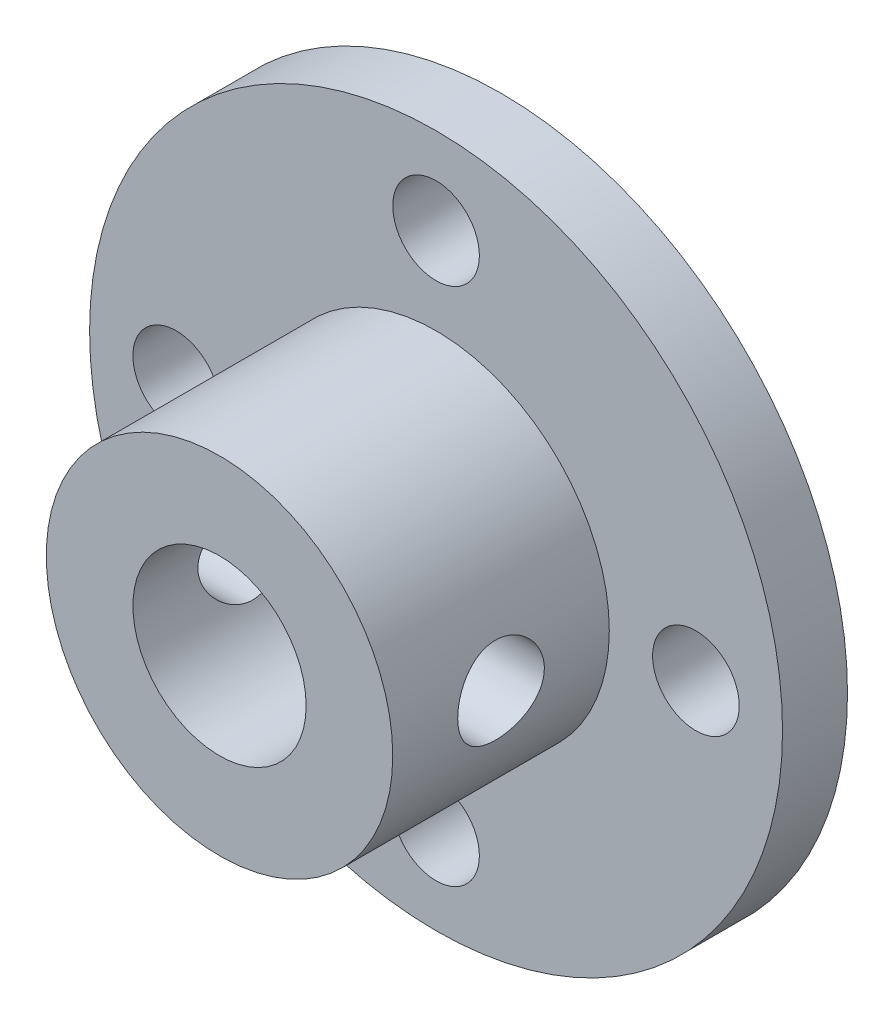
ISO-10303-21;
HEADER;
FILE_DESCRIPTION(('STEP AP214'),'2;1');
FILE_NAME('part.step','',(''),(''),'','','');
FILE_SCHEMA(('AUTOMOTIVE_DESIGN { 1 0 10303 214 1 1 1 1 }'));
ENDSEC;
DATA;
#1=APPLICATION_CONTEXT('core data for automotive mechanical design processes');
#2=APPLICATION_PROTOCOL_DEFINITION('international standard','automotive_design',2000,#1);
#3=PRODUCT_CONTEXT('',#1,'mechanical');
#4=PRODUCT('Part','Part','',(#3));
#5=PRODUCT_RELATED_PRODUCT_CATEGORY('part','',(#4));
#6=PRODUCT_DEFINITION_FORMATION('','',#4);
#7=PRODUCT_DEFINITION_CONTEXT('part definition',#1,'design');
#8=PRODUCT_DEFINITION('design','',#6,#7);
#9=PRODUCT_DEFINITION_SHAPE('','',#8);
#10=(LENGTH_UNIT() NAMED_UNIT(*) SI_UNIT(.MILLI.,.METRE.));
#11=(NAMED_UNIT(*) PLANE_ANGLE_UNIT() SI_UNIT($,.RADIAN.));
#12=(NAMED_UNIT(*) SI_UNIT($,.STERADIAN.) SOLID_ANGLE_UNIT());
#13=UNCERTAINTY_MEASURE_WITH_UNIT(LENGTH_MEASURE(1.E-05),#10,'distance_accuracy_value','');
#14=(GEOMETRIC_REPRESENTATION_CONTEXT(3) GLOBAL_UNCERTAINTY_ASSIGNED_CONTEXT((#13)) GLOBAL_UNIT_ASSIGNED_CONTEXT((#10,
#11,#12)) REPRESENTATION_CONTEXT('',''));
#15=CARTESIAN_POINT('',(0.,0.,0.));
#16=DIRECTION('',(0.,0.,1.));
#17=DIRECTION('',(1.,0.,0.));
#18=AXIS2_PLACEMENT_3D('',#15,#16,#17);
#19=CARTESIAN_POINT('',(-12.,0.,3.));
#20=DIRECTION('',(0.,0.,-1.));
#21=DIRECTION('',(-1.,0.,0.));
#22=AXIS2_PLACEMENT_3D('',#19,#20,#21);
#23=CYLINDRICAL_SURFACE('',#22,2.);
#24=CARTESIAN_POINT('',(-12.,0.,3.));
#25=DIRECTION('',(0.,0.,1.));
#26=DIRECTION('',(1.,0.,0.));
#27=AXIS2_PLACEMENT_3D('',#24,#25,#26);
#28=CIRCLE('',#27,2.);
#29=CARTESIAN_POINT('',(-10.,0.,3.));
#30=VERTEX_POINT('',#29);
#31=EDGE_CURVE('E57',#30,#30,#28,.T.);
#32=ORIENTED_EDGE('',*,*,#31,.T.);
#33=EDGE_LOOP('',(#32));
#34=FACE_BOUND('',#33,.T.);
#35=CARTESIAN_POINT('',(-12.,0.,0.));
#36=DIRECTION('',(0.,0.,1.));
#37=DIRECTION('',(1.,0.,0.));
#38=AXIS2_PLACEMENT_3D('',#35,#36,#37);
#39=CIRCLE('',#38,2.);
#40=CARTESIAN_POINT('',(-10.,0.,0.));
#41=VERTEX_POINT('',#40);
#42=EDGE_CURVE('E71',#41,#41,#39,.T.);
#43=ORIENTED_EDGE('',*,*,#42,.F.);
#44=EDGE_LOOP('',(#43));
#45=FACE_BOUND('',#44,.T.);
#46=ADVANCED_FACE('F39',(#34,#45),#23,.F.);
#47=CARTESIAN_POINT('',(0.,12.,3.));
#48=DIRECTION('',(0.,0.,-1.));
#49=DIRECTION('',(-1.,0.,0.));
#50=AXIS2_PLACEMENT_3D('',#47,#48,#49);
#51=CYLINDRICAL_SURFACE('',#50,2.);
#52=CARTESIAN_POINT('',(0.,12.,3.));
#53=DIRECTION('',(0.,0.,1.));
#54=DIRECTION('',(1.,0.,0.));
#55=AXIS2_PLACEMENT_3D('',#52,#53,#54);
#56=CIRCLE('',#55,2.);
#57=CARTESIAN_POINT('',(2.00000000000004,12.,3.));
#58=VERTEX_POINT('',#57);
#59=EDGE_CURVE('E164',#58,#58,#56,.T.);
#60=ORIENTED_EDGE('',*,*,#59,.T.);
#61=EDGE_LOOP('',(#60));
#62=FACE_BOUND('',#61,.T.);
#63=CARTESIAN_POINT('',(0.,12.,0.));
#64=DIRECTION('',(0.,0.,1.));
#65=DIRECTION('',(1.,0.,0.));
#66=AXIS2_PLACEMENT_3D('',#63,#64,#65);
#67=CIRCLE('',#66,2.);
#68=CARTESIAN_POINT('',(2.00000000000004,12.,0.));
#69=VERTEX_POINT('',#68);
#70=EDGE_CURVE('E68',#69,#69,#67,.T.);
#71=ORIENTED_EDGE('',*,*,#70,.F.);
#72=EDGE_LOOP('',(#71));
#73=FACE_BOUND('',#72,.T.);
#74=ADVANCED_FACE('F127',(#62,#73),#51,.F.);
#75=CARTESIAN_POINT('',(12.,0.,3.));
#76=DIRECTION('',(0.,0.,-1.));
#77=DIRECTION('',(-1.,0.,0.));
#78=AXIS2_PLACEMENT_3D('',#75,#76,#77);
#79=CYLINDRICAL_SURFACE('',#78,2.);
#80=CARTESIAN_POINT('',(12.,0.,3.));
#81=DIRECTION('',(0.,0.,1.));
#82=DIRECTION('',(1.,0.,0.));
#83=AXIS2_PLACEMENT_3D('',#80,#81,#82);
#84=CIRCLE('',#83,2.);
#85=CARTESIAN_POINT('',(14.,0.,3.));
#86=VERTEX_POINT('',#85);
#87=EDGE_CURVE('E141',#86,#86,#84,.T.);
#88=ORIENTED_EDGE('',*,*,#87,.T.);
#89=EDGE_LOOP('',(#88));
#90=FACE_BOUND('',#89,.T.);
#91=CARTESIAN_POINT('',(12.,0.,0.));
#92=DIRECTION('',(0.,0.,1.));
#93=DIRECTION('',(1.,0.,0.));
#94=AXIS2_PLACEMENT_3D('',#91,#92,#93);
#95=CIRCLE('',#94,2.);
#96=CARTESIAN_POINT('',(14.,0.,0.));
#97=VERTEX_POINT('',#96);
#98=EDGE_CURVE('E64',#97,#97,#95,.T.);
#99=ORIENTED_EDGE('',*,*,#98,.F.);
#100=EDGE_LOOP('',(#99));
#101=FACE_BOUND('',#100,.T.);
#102=ADVANCED_FACE('F130',(#90,#101),#79,.F.);
#103=CARTESIAN_POINT('',(-1.25693328198353E-13,-12.,3.));
#104=DIRECTION('',(0.,0.,-1.));
#105=DIRECTION('',(-1.,0.,0.));
#106=AXIS2_PLACEMENT_3D('',#103,#104,#105);
#107=CYLINDRICAL_SURFACE('',#106,2.);
#108=CARTESIAN_POINT('',(-1.25693328198353E-13,-12.,3.));
#109=DIRECTION('',(0.,0.,1.));
#110=DIRECTION('',(1.,0.,0.));
#111=AXIS2_PLACEMENT_3D('',#108,#109,#110);
#112=CIRCLE('',#111,2.);
#113=CARTESIAN_POINT('',(1.99999999999987,-12.,3.));
#114=VERTEX_POINT('',#113);
#115=EDGE_CURVE('E76',#114,#114,#112,.T.);
#116=ORIENTED_EDGE('',*,*,#115,.T.);
#117=EDGE_LOOP('',(#116));
#118=FACE_BOUND('',#117,.T.);
#119=CARTESIAN_POINT('',(-1.25693328198353E-13,-12.,0.));
#120=DIRECTION('',(0.,0.,1.));
#121=DIRECTION('',(1.,0.,0.));
#122=AXIS2_PLACEMENT_3D('',#119,#120,#121);
#123=CIRCLE('',#122,2.);
#124=CARTESIAN_POINT('',(1.99999999999987,-12.,0.));
#125=VERTEX_POINT('',#124);
#126=EDGE_CURVE('E61',#125,#125,#123,.T.);
#127=ORIENTED_EDGE('',*,*,#126,.F.);
#128=EDGE_LOOP('',(#127));
#129=FACE_BOUND('',#128,.T.);
#130=ADVANCED_FACE('F41',(#118,#129),#107,.F.);
#131=CARTESIAN_POINT('',(0.,0.,3.));
#132=DIRECTION('',(0.,0.,-1.));
#133=DIRECTION('',(-1.,0.,0.));
#134=AXIS2_PLACEMENT_3D('',#131,#132,#133);
#135=CYLINDRICAL_SURFACE('',#134,16.);
#136=CARTESIAN_POINT('',(0.,0.,3.));
#137=DIRECTION('',(0.,0.,1.));
#138=DIRECTION('',(1.,0.,0.));
#139=AXIS2_PLACEMENT_3D('',#136,#137,#138);
#140=CIRCLE('',#139,16.);
#141=CARTESIAN_POINT('',(16.,0.,3.));
#142=VERTEX_POINT('',#141);
#143=EDGE_CURVE('E10',#142,#142,#140,.T.);
#144=ORIENTED_EDGE('',*,*,#143,.F.);
#145=EDGE_LOOP('',(#144));
#146=FACE_BOUND('',#145,.T.);
#147=CARTESIAN_POINT('',(0.,0.,0.));
#148=DIRECTION('',(0.,0.,1.));
#149=DIRECTION('',(1.,0.,0.));
#150=AXIS2_PLACEMENT_3D('',#147,#148,#149);
#151=CIRCLE('',#150,16.);
#152=CARTESIAN_POINT('',(16.,0.,0.));
#153=VERTEX_POINT('',#152);
#154=EDGE_CURVE('E74',#153,#153,#151,.T.);
#155=ORIENTED_EDGE('',*,*,#154,.T.);
#156=EDGE_LOOP('',(#155));
#157=FACE_BOUND('',#156,.T.);
#158=ADVANCED_FACE('F117',(#146,#157),#135,.T.);
#159=CARTESIAN_POINT('',(0.,0.,3.));
#160=DIRECTION('',(0.,0.,1.));
#161=DIRECTION('',(1.,0.,0.));
#162=AXIS2_PLACEMENT_3D('',#159,#160,#161);
#163=PLANE('',#162);
#164=ORIENTED_EDGE('',*,*,#115,.F.);
#165=EDGE_LOOP('',(#164));
#166=FACE_BOUND('',#165,.T.);
#167=ORIENTED_EDGE('',*,*,#87,.F.);
#168=EDGE_LOOP('',(#167));
#169=FACE_BOUND('',#168,.T.);
#170=ORIENTED_EDGE('',*,*,#59,.F.);
#171=EDGE_LOOP('',(#170));
#172=FACE_BOUND('',#171,.T.);
#173=ORIENTED_EDGE('',*,*,#31,.F.);
#174=EDGE_LOOP('',(#173));
#175=FACE_BOUND('',#174,.T.);
#176=CARTESIAN_POINT('',(0.,0.,3.));
#177=DIRECTION('',(0.,0.,1.));
#178=DIRECTION('',(1.,0.,0.));
#179=AXIS2_PLACEMENT_3D('',#176,#177,#178);
#180=CIRCLE('',#179,8.);
#181=CARTESIAN_POINT('',(8.,0.,3.));
#182=VERTEX_POINT('',#181);
#183=EDGE_CURVE('E52',#182,#182,#180,.T.);
#184=ORIENTED_EDGE('',*,*,#183,.F.);
#185=EDGE_LOOP('',(#184));
#186=FACE_BOUND('',#185,.T.);
#187=ORIENTED_EDGE('',*,*,#143,.T.);
#188=EDGE_LOOP('',(#187));
#189=FACE_BOUND('',#188,.T.);
#190=ADVANCED_FACE('F113',(#166,#169,#172,#175,#186,#189),#163,.T.);
#191=CARTESIAN_POINT('',(0.,0.,0.));
#192=DIRECTION('',(0.,0.,1.));
#193=DIRECTION('',(1.,0.,0.));
#194=AXIS2_PLACEMENT_3D('',#191,#192,#193);
#195=PLANE('',#194);
#196=ORIENTED_EDGE('',*,*,#126,.T.);
#197=EDGE_LOOP('',(#196));
#198=FACE_BOUND('',#197,.T.);
#199=ORIENTED_EDGE('',*,*,#98,.T.);
#200=EDGE_LOOP('',(#199));
#201=FACE_BOUND('',#200,.T.);
#202=ORIENTED_EDGE('',*,*,#70,.T.);
#203=EDGE_LOOP('',(#202));
#204=FACE_BOUND('',#203,.T.);
#205=ORIENTED_EDGE('',*,*,#42,.T.);
#206=EDGE_LOOP('',(#205));
#207=FACE_BOUND('',#206,.T.);
#208=ORIENTED_EDGE('',*,*,#154,.F.);
#209=EDGE_LOOP('',(#208));
#210=FACE_BOUND('',#209,.T.);
#211=CARTESIAN_POINT('',(0.,0.,0.));
#212=DIRECTION('',(0.,0.,1.));
#213=DIRECTION('',(1.,0.,0.));
#214=AXIS2_PLACEMENT_3D('',#211,#212,#213);
#215=CIRCLE('',#214,4.);
#216=CARTESIAN_POINT('',(4.,0.,0.));
#217=VERTEX_POINT('',#216);
#218=EDGE_CURVE('E153',#217,#217,#215,.T.);
#219=ORIENTED_EDGE('',*,*,#218,.T.);
#220=EDGE_LOOP('',(#219));
#221=FACE_BOUND('',#220,.T.);
#222=ADVANCED_FACE('F111',(#198,#201,#204,#207,#210,#221),#195,.F.);
#223=CARTESIAN_POINT('',(0.,0.,13.));
#224=DIRECTION('',(0.,0.,-1.));
#225=DIRECTION('',(-1.,0.,0.));
#226=AXIS2_PLACEMENT_3D('',#223,#224,#225);
#227=CYLINDRICAL_SURFACE('',#226,4.);
#228=CARTESIAN_POINT('',(-4.,0.,10.));
#229=CARTESIAN_POINT('',(-3.99999426810082,-0.105143925902467,9.99999339536562));
#230=CARTESIAN_POINT('',(-3.99580982039513,-0.210413199395125,9.99165985375789));
#231=CARTESIAN_POINT('',(-3.97948312074314,-0.417840470537792,9.95869423931692));
#232=CARTESIAN_POINT('',(-3.96732575657839,-0.519992173427259,9.93403121400437));
#233=CARTESIAN_POINT('',(-3.93632558806751,-0.717867089760898,9.86961238276674));
#234=CARTESIAN_POINT('',(-3.91750878355075,-0.813613605878293,9.82991523150407));
#235=CARTESIAN_POINT('',(-3.87491553031523,-0.996945233613197,9.73685875727003));
#236=CARTESIAN_POINT('',(-3.85113947267051,-1.08453098798012,9.68350051150227));
#237=CARTESIAN_POINT('',(-3.79912516516124,-1.25501563552382,9.56096550102943));
#238=CARTESIAN_POINT('',(-3.77070398255074,-1.33731042224422,9.49102704152072));
#239=CARTESIAN_POINT('',(-3.71319940493486,-1.48955888973396,9.33895704150593));
#240=CARTESIAN_POINT('',(-3.68411552418069,-1.55950316621353,9.25681629645512));
#241=CARTESIAN_POINT('',(-3.62597902394695,-1.69050400090055,9.07503330095324));
#242=CARTESIAN_POINT('',(-3.59710373940264,-1.75045067110327,8.97452780330818));
#243=CARTESIAN_POINT('',(-3.54571957544641,-1.85233645378139,8.76326532802757));
#244=CARTESIAN_POINT('',(-3.52320615213979,-1.89428842993267,8.6525157425545));
#245=CARTESIAN_POINT('',(-3.48915734075617,-1.95626488437718,8.43066978915616));
#246=CARTESIAN_POINT('',(-3.47704543167427,-1.97745171416088,8.31999109586521));
#247=CARTESIAN_POINT('',(-3.46363779897055,-2.00085398661769,8.09604232444105));
#248=CARTESIAN_POINT('',(-3.46233138686576,-2.00308817674615,7.98277491825769));
#249=CARTESIAN_POINT('',(-3.47021860514497,-1.98937457434459,7.77142795136926));
#250=CARTESIAN_POINT('',(-3.47817527324027,-1.97556911907364,7.6731519375539));
#251=CARTESIAN_POINT('',(-3.50152457467701,-1.93387969811386,7.48055618125392));
#252=CARTESIAN_POINT('',(-3.51691957663553,-1.9059912477953,7.38623770938937));
#253=CARTESIAN_POINT('',(-3.55374952825482,-1.83641956077201,7.20154173486868));
#254=CARTESIAN_POINT('',(-3.57531681327997,-1.79443013423199,7.11130720242842));
#255=CARTESIAN_POINT('',(-3.62206808562807,-1.698083375336,6.93873141481999));
#256=CARTESIAN_POINT('',(-3.64725369560381,-1.64372048762494,6.85639372879982));
#257=CARTESIAN_POINT('',(-3.70226315806572,-1.51613210982558,6.69095749451355));
#258=CARTESIAN_POINT('',(-3.73227020473492,-1.44138891673856,6.60908625284769));
#259=CARTESIAN_POINT('',(-3.79095246600814,-1.27911115748275,6.4585291628182));
#260=CARTESIAN_POINT('',(-3.81962703917602,-1.19157051314857,6.38984961593223));
#261=CARTESIAN_POINT('',(-3.87403974565928,-1.0010330116637,6.26462867794055));
#262=CARTESIAN_POINT('',(-3.89957968324015,-0.897507183198818,6.20879905510852));
#263=CARTESIAN_POINT('',(-3.94315762242485,-0.680932430977593,6.11580594191398));
#264=CARTESIAN_POINT('',(-3.96120157887106,-0.567891152530552,6.07862762996967));
#265=CARTESIAN_POINT('',(-3.98648667482871,-0.345532983321404,6.02704919256665));
#266=CARTESIAN_POINT('',(-3.9944987660262,-0.236683061096652,6.01101752850644));
#267=CARTESIAN_POINT('',(-4.00146026918207,-0.0175591998987032,5.99707053773103));
#268=CARTESIAN_POINT('',(-4.00041397442637,0.0927140397398176,5.99914662872106));
#269=CARTESIAN_POINT('',(-3.9898238450687,0.302465943971974,6.02041337683749));
#270=CARTESIAN_POINT('',(-3.98094491376337,0.402118816099861,6.03826506545999));
#271=CARTESIAN_POINT('',(-3.9564434262968,0.596813784603883,6.08847614379024));
#272=CARTESIAN_POINT('',(-3.94082012668824,0.691855371382174,6.12083713290699));
#273=CARTESIAN_POINT('',(-3.90368502827176,0.877777216899146,6.19999693286607));
#274=CARTESIAN_POINT('',(-3.88201763539261,0.968460794011607,6.24718210023258));
#275=CARTESIAN_POINT('',(-3.83487948634835,1.14092272339854,6.35421507129314));
#276=CARTESIAN_POINT('',(-3.80940711133877,1.22269725955318,6.41406826919079));
#277=CARTESIAN_POINT('',(-3.75416442672396,1.38353537857843,6.55152085066143));
#278=CARTESIAN_POINT('',(-3.72421769686998,1.46154415563805,6.6302857368903));
#279=CARTESIAN_POINT('',(-3.6652478321764,1.60371264223771,6.79985030255546));
#280=CARTESIAN_POINT('',(-3.63622534800094,1.66786277142375,6.89065823769584));
#281=CARTESIAN_POINT('',(-3.58102384412979,1.78341582895804,7.08728730834595));
#282=CARTESIAN_POINT('',(-3.55505059178121,1.8340509916005,7.19362253218896));
#283=CARTESIAN_POINT('',(-3.51148144588269,1.91616565186941,7.41502013514993));
#284=CARTESIAN_POINT('',(-3.493874764435,1.94766983173403,7.53007105293378));
#285=CARTESIAN_POINT('',(-3.47123002051604,1.98772337493374,7.75382044576941));
#286=CARTESIAN_POINT('',(-3.4651476693013,1.9981859928109,7.86206850687048));
#287=CARTESIAN_POINT('',(-3.46330709283207,2.0013783087524,8.07889413432905));
#288=CARTESIAN_POINT('',(-3.4675443925278,1.99411569324648,8.18747153747572));
#289=CARTESIAN_POINT('',(-3.48475724102153,1.96385225118662,8.39096700306687));
#290=CARTESIAN_POINT('',(-3.49686188965317,1.94241662868607,8.48620094028948));
#291=CARTESIAN_POINT('',(-3.52742032375305,1.88635071644882,8.67161623884873));
#292=CARTESIAN_POINT('',(-3.54587615139337,1.85171618231984,8.76179596418406));
#293=CARTESIAN_POINT('',(-3.58857060729071,1.76763149060113,8.94124970197307));
#294=CARTESIAN_POINT('',(-3.61311444791841,1.7173422756314,9.03005580365806));
#295=CARTESIAN_POINT('',(-3.66470663269721,1.60430194327478,9.19854907236252));
#296=CARTESIAN_POINT('',(-3.69175627591221,1.54154434248312,9.27823146104222));
#297=CARTESIAN_POINT('',(-3.74924646316184,1.39640665332275,9.43628396470935));
#298=CARTESIAN_POINT('',(-3.77969966613256,1.31256884599452,9.51331820470058));
#299=CARTESIAN_POINT('',(-3.83755504519861,1.13230961246639,9.65252596687054));
#300=CARTESIAN_POINT('',(-3.8649555725239,1.03588144661039,9.71469147893981));
#301=CARTESIAN_POINT('',(-3.91396019133075,0.83186319356589,9.82247272542414));
#302=CARTESIAN_POINT('',(-3.93552192987866,0.72419900755346,9.86796833847294));
#303=CARTESIAN_POINT('',(-3.97002682597974,0.501484202276172,9.93961633551482));
#304=CARTESIAN_POINT('',(-3.98299446726136,0.386455599178199,9.96582369361143));
#305=CARTESIAN_POINT('',(-3.99390923826956,0.225203892981789,9.98779482217148));
#306=CARTESIAN_POINT('',(-3.99618730680502,0.180323758883128,9.99236528173268));
#307=CARTESIAN_POINT('',(-3.99923393953631,0.0903034636101822,9.99846933102817));
#308=CARTESIAN_POINT('',(-4.00000246206762,0.0451632952932564,10.0000028369404));
#309=CARTESIAN_POINT('',(-4.,0.,10.));
#310=B_SPLINE_CURVE_WITH_KNOTS('',3,(#228,#229,#230,#231,#232,#233,#234,#235,#236,#237,#238,
#239,#240,#241,#242,#243,#244,#245,#246,#247,#248,#249,#250,#251,#252,#253,#254,#255,#256,#257,
#258,#259,#260,#261,#262,#263,#264,#265,#266,#267,#268,#269,#270,#271,#272,#273,#274,#275,#276,
#277,#278,#279,#280,#281,#282,#283,#284,#285,#286,#287,#288,#289,#290,#291,#292,#293,#294,#295,
#296,#297,#298,#299,#300,#301,#302,#303,#304,#305,#306,#307,#308,#309),.UNSPECIFIED.,.T.,.F.,(4,
2,2,2,2,2,2,2,2,2,2,2,2,2,2,2,2,2,2,2,2,2,2,2,2,2,2,2,2,2,2,2,2,2,2,2,2,2,2,2,4),(0.,
0.315248514840585,0.631096299418395,0.945724310984596,1.26032752116314,1.59396351743618,
1.92785247530807,2.28763452861505,2.64715895796562,2.98516024280459,3.32282714658041,
3.62011424818641,3.91749607851357,4.22180480336974,4.52625042520443,4.86929882667757,
5.21251069197373,5.57166044428881,5.93052433824559,6.25966580942691,6.58865129022952,
6.89213813012244,7.19565843261863,7.50785712055797,7.82018901496679,8.16319221288838,
8.50643177230864,8.86629364323452,9.22569023890902,9.55058615006093,9.87534119729357,
10.1691586049771,10.463070575767,10.7767291356057,11.0905512228726,11.4425048551434,
11.7946476676249,12.1492802732705,12.502898172423,12.6383056026783,12.7737167702213),.UNSPECIFIED.);
#311=CARTESIAN_POINT('',(-4.,0.,10.));
#312=VERTEX_POINT('',#311);
#313=EDGE_CURVE('E102',#312,#312,#310,.T.);
#314=ORIENTED_EDGE('',*,*,#313,.F.);
#315=EDGE_LOOP('',(#314));
#316=FACE_BOUND('',#315,.T.);
#317=CARTESIAN_POINT('',(4.,0.,6.));
#318=CARTESIAN_POINT('',(3.99999426810083,-0.105143925902467,6.00000660463438));
#319=CARTESIAN_POINT('',(3.99580982039513,-0.210413199395125,6.00834014624211));
#320=CARTESIAN_POINT('',(3.97948312074314,-0.417840470537792,6.04130576068308));
#321=CARTESIAN_POINT('',(3.96732575657839,-0.519992173427259,6.06596878599563));
#322=CARTESIAN_POINT('',(3.93632558806751,-0.717867089760897,6.13038761723326));
#323=CARTESIAN_POINT('',(3.91750878355075,-0.813613605878292,6.17008476849594));
#324=CARTESIAN_POINT('',(3.87491553031523,-0.996945233613197,6.26314124272997));
#325=CARTESIAN_POINT('',(3.8511394726705,-1.08453098798012,6.31649948849773));
#326=CARTESIAN_POINT('',(3.79912516516124,-1.25501563552382,6.43903449897057));
#327=CARTESIAN_POINT('',(3.77070398255074,-1.33731042224422,6.50897295847928));
#328=CARTESIAN_POINT('',(3.71319940493486,-1.48955888973396,6.66104295849407));
#329=CARTESIAN_POINT('',(3.68411552418069,-1.55950316621353,6.74318370354488));
#330=CARTESIAN_POINT('',(3.62597902394695,-1.69050400090055,6.92496669904676));
#331=CARTESIAN_POINT('',(3.59710373940264,-1.75045067110327,7.02547219669182));
#332=CARTESIAN_POINT('',(3.54571957544641,-1.85233645378139,7.23673467197243));
#333=CARTESIAN_POINT('',(3.52320615213979,-1.89428842993267,7.3474842574455));
#334=CARTESIAN_POINT('',(3.48915734075617,-1.95626488437718,7.56933021084384));
#335=CARTESIAN_POINT('',(3.47704543167427,-1.97745171416088,7.68000890413479));
#336=CARTESIAN_POINT('',(3.46363779897055,-2.00085398661769,7.90395767555895));
#337=CARTESIAN_POINT('',(3.46233138686576,-2.00308817674615,8.01722508174231));
#338=CARTESIAN_POINT('',(3.47021860514497,-1.98937457434459,8.22857204863074));
#339=CARTESIAN_POINT('',(3.47817527324027,-1.97556911907364,8.3268480624461));
#340=CARTESIAN_POINT('',(3.50152457467701,-1.93387969811386,8.51944381874609));
#341=CARTESIAN_POINT('',(3.51691957663553,-1.9059912477953,8.61376229061063));
#342=CARTESIAN_POINT('',(3.55374952825482,-1.83641956077201,8.79845826513132));
#343=CARTESIAN_POINT('',(3.57531681327997,-1.79443013423199,8.88869279757158));
#344=CARTESIAN_POINT('',(3.62206808562807,-1.69808337533601,9.06126858518001));
#345=CARTESIAN_POINT('',(3.64725369560381,-1.64372048762494,9.14360627120018));
#346=CARTESIAN_POINT('',(3.70226315806572,-1.51613210982558,9.30904250548645));
#347=CARTESIAN_POINT('',(3.73227020473492,-1.44138891673856,9.39091374715231));
#348=CARTESIAN_POINT('',(3.79095246600814,-1.27911115748275,9.5414708371818));
#349=CARTESIAN_POINT('',(3.81962703917602,-1.19157051314857,9.61015038406777));
#350=CARTESIAN_POINT('',(3.87403974565928,-1.0010330116637,9.73537132205946));
#351=CARTESIAN_POINT('',(3.89957968324014,-0.897507183198818,9.79120094489148));
#352=CARTESIAN_POINT('',(3.94315762242484,-0.680932430977594,9.88419405808602));
#353=CARTESIAN_POINT('',(3.96120157887106,-0.567891152530552,9.92137237003033));
#354=CARTESIAN_POINT('',(3.98648667482871,-0.345532983321404,9.97295080743335));
#355=CARTESIAN_POINT('',(3.9944987660262,-0.236683061096652,9.98898247149356));
#356=CARTESIAN_POINT('',(4.00146026918207,-0.0175591998987035,10.002929462269));
#357=CARTESIAN_POINT('',(4.00041397442637,0.0927140397398172,10.0008533712789));
#358=CARTESIAN_POINT('',(3.9898238450687,0.302465943971973,9.97958662316251));
#359=CARTESIAN_POINT('',(3.98094491376337,0.40211881609986,9.96173493454001));
#360=CARTESIAN_POINT('',(3.95644342629681,0.596813784603882,9.91152385620976));
#361=CARTESIAN_POINT('',(3.94082012668824,0.691855371382173,9.87916286709301));
#362=CARTESIAN_POINT('',(3.90368502827176,0.877777216899145,9.80000306713393));
#363=CARTESIAN_POINT('',(3.88201763539262,0.968460794011606,9.75281789976743));
#364=CARTESIAN_POINT('',(3.83487948634835,1.14092272339854,9.64578492870687));
#365=CARTESIAN_POINT('',(3.80940711133877,1.22269725955318,9.58593173080921));
#366=CARTESIAN_POINT('',(3.75416442672396,1.38353537857843,9.44847914933857));
#367=CARTESIAN_POINT('',(3.72421769686999,1.46154415563805,9.36971426310971));
#368=CARTESIAN_POINT('',(3.6652478321764,1.60371264223771,9.20014969744455));
#369=CARTESIAN_POINT('',(3.63622534800094,1.66786277142375,9.10934176230416));
#370=CARTESIAN_POINT('',(3.58102384412979,1.78341582895804,8.91271269165405));
#371=CARTESIAN_POINT('',(3.55505059178121,1.8340509916005,8.80637746781104));
#372=CARTESIAN_POINT('',(3.51148144588269,1.91616565186941,8.58497986485007));
#373=CARTESIAN_POINT('',(3.493874764435,1.94766983173403,8.46992894706622));
#374=CARTESIAN_POINT('',(3.47123002051604,1.98772337493374,8.24617955423059));
#375=CARTESIAN_POINT('',(3.4651476693013,1.9981859928109,8.13793149312952));
#376=CARTESIAN_POINT('',(3.46330709283206,2.0013783087524,7.92110586567095));
#377=CARTESIAN_POINT('',(3.4675443925278,1.99411569324648,7.81252846252428));
#378=CARTESIAN_POINT('',(3.48475724102153,1.96385225118662,7.60903299693313));
#379=CARTESIAN_POINT('',(3.49686188965317,1.94241662868607,7.51379905971052));
#380=CARTESIAN_POINT('',(3.52742032375305,1.88635071644882,7.32838376115127));
#381=CARTESIAN_POINT('',(3.54587615139337,1.85171618231984,7.23820403581594));
#382=CARTESIAN_POINT('',(3.58857060729071,1.76763149060113,7.05875029802693));
#383=CARTESIAN_POINT('',(3.61311444791841,1.7173422756314,6.96994419634194));
#384=CARTESIAN_POINT('',(3.66470663269721,1.60430194327479,6.80145092763748));
#385=CARTESIAN_POINT('',(3.69175627591221,1.54154434248312,6.72176853895778));
#386=CARTESIAN_POINT('',(3.74924646316184,1.39640665332275,6.56371603529065));
#387=CARTESIAN_POINT('',(3.77969966613256,1.31256884599452,6.48668179529942));
#388=CARTESIAN_POINT('',(3.83755504519861,1.13230961246639,6.34747403312946));
#389=CARTESIAN_POINT('',(3.8649555725239,1.03588144661039,6.28530852106019));
#390=CARTESIAN_POINT('',(3.91396019133075,0.831863193565892,6.17752727457586));
#391=CARTESIAN_POINT('',(3.93552192987866,0.724199007553462,6.13203166152707));
#392=CARTESIAN_POINT('',(3.97002682597974,0.501484202276174,6.06038366448518));
#393=CARTESIAN_POINT('',(3.98299446726136,0.386455599178201,6.03417630638857));
#394=CARTESIAN_POINT('',(3.99390923826956,0.225203892981791,6.01220517782852));
#395=CARTESIAN_POINT('',(3.99618730680501,0.18032375888313,6.00763471826732));
#396=CARTESIAN_POINT('',(3.99923393953631,0.0903034636101833,6.00153066897183));
#397=CARTESIAN_POINT('',(4.00000246206762,0.0451632952932569,5.99999716305958));
#398=CARTESIAN_POINT('',(4.,0.,6.));
#399=B_SPLINE_CURVE_WITH_KNOTS('',3,(#317,#318,#319,#320,#321,#322,#323,#324,#325,#326,#327,
#328,#329,#330,#331,#332,#333,#334,#335,#336,#337,#338,#339,#340,#341,#342,#343,#344,#345,#346,
#347,#348,#349,#350,#351,#352,#353,#354,#355,#356,#357,#358,#359,#360,#361,#362,#363,#364,#365,
#366,#367,#368,#369,#370,#371,#372,#373,#374,#375,#376,#377,#378,#379,#380,#381,#382,#383,#384,
#385,#386,#387,#388,#389,#390,#391,#392,#393,#394,#395,#396,#397,#398),.UNSPECIFIED.,.T.,.F.,(4,
2,2,2,2,2,2,2,2,2,2,2,2,2,2,2,2,2,2,2,2,2,2,2,2,2,2,2,2,2,2,2,2,2,2,2,2,2,2,2,4),(0.,
0.315248514840585,0.631096299418395,0.945724310984597,1.26032752116313,1.59396351743618,
1.92785247530807,2.28763452861505,2.64715895796562,2.98516024280459,3.32282714658041,
3.62011424818641,3.91749607851357,4.22180480336974,4.52625042520443,4.86929882667757,
5.21251069197372,5.57166044428881,5.93052433824559,6.25966580942691,6.58865129022952,
6.89213813012244,7.19565843261863,7.50785712055797,7.82018901496678,8.16319221288837,
8.50643177230863,8.86629364323451,9.22569023890902,9.55058615006093,9.87534119729357,
10.1691586049771,10.463070575767,10.7767291356057,11.0905512228726,11.4425048551434,
11.7946476676249,12.1492802732705,12.502898172423,12.6383056026783,12.7737167702213),.UNSPECIFIED.);
#400=CARTESIAN_POINT('',(4.,0.,6.));
#401=VERTEX_POINT('',#400);
#402=EDGE_CURVE('E97',#401,#401,#399,.T.);
#403=ORIENTED_EDGE('',*,*,#402,.F.);
#404=EDGE_LOOP('',(#403));
#405=FACE_BOUND('',#404,.T.);
#406=CARTESIAN_POINT('',(0.,0.,13.));
#407=DIRECTION('',(0.,0.,1.));
#408=DIRECTION('',(1.,0.,0.));
#409=AXIS2_PLACEMENT_3D('',#406,#407,#408);
#410=CIRCLE('',#409,4.);
#411=CARTESIAN_POINT('',(4.,0.,13.));
#412=VERTEX_POINT('',#411);
#413=EDGE_CURVE('E155',#412,#412,#410,.T.);
#414=ORIENTED_EDGE('',*,*,#413,.T.);
#415=EDGE_LOOP('',(#414));
#416=FACE_BOUND('',#415,.T.);
#417=ORIENTED_EDGE('',*,*,#218,.F.);
#418=EDGE_LOOP('',(#417));
#419=FACE_BOUND('',#418,.T.);
#420=ADVANCED_FACE('F107',(#316,#405,#416,#419),#227,.F.);
#421=CARTESIAN_POINT('',(0.,0.,13.));
#422=DIRECTION('',(0.,0.,-1.));
#423=DIRECTION('',(-1.,0.,0.));
#424=AXIS2_PLACEMENT_3D('',#421,#422,#423);
#425=CYLINDRICAL_SURFACE('',#424,8.);
#426=CARTESIAN_POINT('',(-8.,0.,10.));
#427=CARTESIAN_POINT('',(-7.9999981315735,-0.110501451559641,9.99999689901579));
#428=CARTESIAN_POINT('',(-7.99768770842435,-0.221037543774351,9.99081126563495));
#429=CARTESIAN_POINT('',(-7.98869485106526,-0.438941765027377,9.95436646492399));
#430=CARTESIAN_POINT('',(-7.98200993893301,-0.546308062494319,9.92709705394953));
#431=CARTESIAN_POINT('',(-7.96500835109376,-0.754694496243435,9.85541432871722));
#432=CARTESIAN_POINT('',(-7.95469603789411,-0.855722084573336,9.81102160171297));
#433=CARTESIAN_POINT('',(-7.93153791743495,-1.04889617587257,9.70642481327354));
#434=CARTESIAN_POINT('',(-7.91869202472209,-1.14104237913168,9.64622021850804));
#435=CARTESIAN_POINT('',(-7.89156551455591,-1.31573590306789,9.51039894712776));
#436=CARTESIAN_POINT('',(-7.87726276197502,-1.39807425341474,9.43451790005459));
#437=CARTESIAN_POINT('',(-7.84898160157248,-1.54899856960443,9.27006372678795));
#438=CARTESIAN_POINT('',(-7.83500323053157,-1.61758298259892,9.18148916940409));
#439=CARTESIAN_POINT('',(-7.80873034264225,-1.74003539039863,8.99253969768401));
#440=CARTESIAN_POINT('',(-7.79646392619748,-1.79366962123352,8.89200902558836));
#441=CARTESIAN_POINT('',(-7.77532659757355,-1.88319587806766,8.68300211778662));
#442=CARTESIAN_POINT('',(-7.76645514259224,-1.91909074058685,8.57452715555731));
#443=CARTESIAN_POINT('',(-7.7533396892843,-1.97140644907302,8.35500866906445));
#444=CARTESIAN_POINT('',(-7.74900654662681,-1.98820302444274,8.24406013861601));
#445=CARTESIAN_POINT('',(-7.74519149946122,-2.00301570008854,8.02084190800087));
#446=CARTESIAN_POINT('',(-7.74570880570571,-2.00103485575748,7.90857242574382));
#447=CARTESIAN_POINT('',(-7.75145607355756,-1.97864869951961,7.6887789230062));
#448=CARTESIAN_POINT('',(-7.75657150676391,-1.95869112025418,7.58120583804623));
#449=CARTESIAN_POINT('',(-7.77075612894758,-1.90163224920399,7.37098526545192));
#450=CARTESIAN_POINT('',(-7.77982559958985,-1.86452973609252,7.26833812929477));
#451=CARTESIAN_POINT('',(-7.80100151874212,-1.77385263724958,7.06968264499716));
#452=CARTESIAN_POINT('',(-7.81313769959755,-1.72011555631056,6.97375177094724));
#453=CARTESIAN_POINT('',(-7.83906281127988,-1.59780836801993,6.79210838699091));
#454=CARTESIAN_POINT('',(-7.85285203112837,-1.52923566507845,6.70639766924367));
#455=CARTESIAN_POINT('',(-7.88101174053188,-1.37688456624163,6.54506184574079));
#456=CARTESIAN_POINT('',(-7.89538759304001,-1.29272834422115,6.46979401325153));
#457=CARTESIAN_POINT('',(-7.92274620771675,-1.11281589000493,6.3343716767148));
#458=CARTESIAN_POINT('',(-7.93572892732543,-1.01705930361059,6.27421763431525));
#459=CARTESIAN_POINT('',(-7.9589030945892,-0.816154518241856,6.17059921836749));
#460=CARTESIAN_POINT('',(-7.96908480170303,-0.710975190944832,6.12719287966076));
#461=CARTESIAN_POINT('',(-7.98543889321888,-0.494501344190511,6.05877692572057));
#462=CARTESIAN_POINT('',(-7.99161204452374,-0.383207998867314,6.03376379144248));
#463=CARTESIAN_POINT('',(-7.999139990285,-0.160719960520036,6.00338991258822));
#464=CARTESIAN_POINT('',(-8.00061404677705,-0.0495956266509468,5.9975426318996));
#465=CARTESIAN_POINT('',(-7.99891739752601,0.172043833068677,6.00433200274065));
#466=CARTESIAN_POINT('',(-7.99574710989128,0.282559012859459,6.01696699039884));
#467=CARTESIAN_POINT('',(-7.98519441503143,0.498152358368655,6.05996121118851));
#468=CARTESIAN_POINT('',(-7.97787512247748,0.603286825291672,6.09005501796932));
#469=CARTESIAN_POINT('',(-7.95984942178845,0.807009723270014,6.16680944537126));
#470=CARTESIAN_POINT('',(-7.94914267159856,0.905597492043512,6.21347173908423));
#471=CARTESIAN_POINT('',(-7.92524410568414,1.0953641792398,6.3229815051663));
#472=CARTESIAN_POINT('',(-7.91201156489243,1.18638058911444,6.38610148319568));
#473=CARTESIAN_POINT('',(-7.88459345583226,1.35670215152433,6.52638654506263));
#474=CARTESIAN_POINT('',(-7.87040772335606,1.43600527863068,6.60355405282254));
#475=CARTESIAN_POINT('',(-7.84225275947695,1.58265409076364,6.77200261445928));
#476=CARTESIAN_POINT('',(-7.82829738916375,1.64965849016271,6.86358360400323));
#477=CARTESIAN_POINT('',(-7.80257171169652,1.7673476786836,7.05697684595429));
#478=CARTESIAN_POINT('',(-7.79080130756035,1.81803319221058,7.15878864394634));
#479=CARTESIAN_POINT('',(-7.77090792979554,1.90126856081239,7.3692076298841));
#480=CARTESIAN_POINT('',(-7.76276340389207,1.93392586220542,7.47777017112535));
#481=CARTESIAN_POINT('',(-7.75102325453578,1.98046087993837,7.69907951718548));
#482=CARTESIAN_POINT('',(-7.74742663626581,1.99434270330488,7.81182540137665));
#483=CARTESIAN_POINT('',(-7.74526534938609,2.00271812044533,8.03482803180693));
#484=CARTESIAN_POINT('',(-7.74655910304351,1.99775719704016,8.14506324683297));
#485=CARTESIAN_POINT('',(-7.7537054534379,1.96983637108382,8.36307185155731));
#486=CARTESIAN_POINT('',(-7.75955795855809,1.94687683024903,8.47084529068487));
#487=CARTESIAN_POINT('',(-7.77508347576963,1.88390842592373,8.68027794542054));
#488=CARTESIAN_POINT('',(-7.78473353648412,1.84400187290717,8.78196974032028));
#489=CARTESIAN_POINT('',(-7.80677007633105,1.74835321814009,8.97728717695159));
#490=CARTESIAN_POINT('',(-7.81915693494364,1.69260892004558,9.07091169758256));
#491=CARTESIAN_POINT('',(-7.8456751235135,1.56515699818285,9.25007283866936));
#492=CARTESIAN_POINT('',(-7.85984353109009,1.49307088388301,9.33533476456528));
#493=CARTESIAN_POINT('',(-7.88810702995048,1.33571916158631,9.49272939306054));
#494=CARTESIAN_POINT('',(-7.90220210302746,1.25045042834819,9.56485897348396));
#495=CARTESIAN_POINT('',(-7.92903540863551,1.06729011560345,9.69521507808614));
#496=CARTESIAN_POINT('',(-7.94174444487824,0.969197896421848,9.75316615156211));
#497=CARTESIAN_POINT('',(-7.96406566633491,0.764354746013968,9.85166328392071));
#498=CARTESIAN_POINT('',(-7.97368006933042,0.657610084582319,9.89222181419805));
#499=CARTESIAN_POINT('',(-7.98730746087389,0.459213670991296,9.94876244043954));
#500=CARTESIAN_POINT('',(-7.9920344673692,0.368506894544092,9.96793499073791));
#501=CARTESIAN_POINT('',(-7.99838140309264,0.185208095381712,9.99355459149592));
#502=CARTESIAN_POINT('',(-8.00000156601192,0.0926162149901554,10.0000025990737));
#503=CARTESIAN_POINT('',(-8.,0.,10.));
#504=B_SPLINE_CURVE_WITH_KNOTS('',3,(#426,#427,#428,#429,#430,#431,#432,#433,#434,#435,#436,
#437,#438,#439,#440,#441,#442,#443,#444,#445,#446,#447,#448,#449,#450,#451,#452,#453,#454,#455,
#456,#457,#458,#459,#460,#461,#462,#463,#464,#465,#466,#467,#468,#469,#470,#471,#472,#473,#474,
#475,#476,#477,#478,#479,#480,#481,#482,#483,#484,#485,#486,#487,#488,#489,#490,#491,#492,#493,
#494,#495,#496,#497,#498,#499,#500,#501,#502,#503),.UNSPECIFIED.,.T.,.F.,(4,2,2,2,2,2,2,2,2,2,2,
2,2,2,2,2,2,2,2,2,2,2,2,2,2,2,2,2,2,2,2,2,2,2,2,2,2,2,4),(0.,0.331164949962519,
0.662517650351866,0.993473203048142,1.32443992022577,1.66152580582852,1.99864972773416,
2.34078196727742,2.68285948225824,3.01808393468093,3.3532538415469,3.68029996013785,
4.00736937959146,4.337740371696,4.66816921119311,5.00802001296453,5.34788119415424,
5.6889097201658,6.02987298255951,6.36211078603462,6.69431868154751,7.02160366023144,
7.34892169767481,7.68204783424897,8.01523150681786,8.35659345610395,8.69794025003772,
9.03723006156476,9.37644564340971,9.70591707202577,10.0353818794581,10.3628853408369,
10.6904342418696,11.0265276855097,11.3627009303165,11.7049624733721,12.0469781843289,
12.3245632392729,12.6021274139515),.UNSPECIFIED.);
#505=CARTESIAN_POINT('',(-8.,0.,10.));
#506=VERTEX_POINT('',#505);
#507=EDGE_CURVE('E43',#506,#506,#504,.T.);
#508=ORIENTED_EDGE('',*,*,#507,.T.);
#509=EDGE_LOOP('',(#508));
#510=FACE_BOUND('',#509,.T.);
#511=CARTESIAN_POINT('',(8.00000000000001,0.,6.));
#512=CARTESIAN_POINT('',(7.9999981315735,-0.110501451559641,6.00000310098421));
#513=CARTESIAN_POINT('',(7.99768770842435,-0.221037543774351,6.00918873436505));
#514=CARTESIAN_POINT('',(7.98869485106526,-0.438941765027377,6.04563353507601));
#515=CARTESIAN_POINT('',(7.98200993893301,-0.546308062494319,6.07290294605047));
#516=CARTESIAN_POINT('',(7.96500835109376,-0.754694496243435,6.14458567128278));
#517=CARTESIAN_POINT('',(7.95469603789411,-0.855722084573335,6.18897839828703));
#518=CARTESIAN_POINT('',(7.93153791743495,-1.04889617587257,6.29357518672646));
#519=CARTESIAN_POINT('',(7.91869202472209,-1.14104237913168,6.35377978149196));
#520=CARTESIAN_POINT('',(7.89156551455591,-1.31573590306789,6.48960105287224));
#521=CARTESIAN_POINT('',(7.87726276197502,-1.39807425341474,6.56548209994541));
#522=CARTESIAN_POINT('',(7.84898160157248,-1.54899856960443,6.72993627321205));
#523=CARTESIAN_POINT('',(7.83500323053157,-1.61758298259892,6.81851083059591));
#524=CARTESIAN_POINT('',(7.80873034264225,-1.74003539039863,7.00746030231599));
#525=CARTESIAN_POINT('',(7.79646392619748,-1.79366962123352,7.10799097441164));
#526=CARTESIAN_POINT('',(7.77532659757355,-1.88319587806766,7.31699788221338));
#527=CARTESIAN_POINT('',(7.76645514259225,-1.91909074058685,7.42547284444269));
#528=CARTESIAN_POINT('',(7.7533396892843,-1.97140644907302,7.64499133093555));
#529=CARTESIAN_POINT('',(7.74900654662681,-1.98820302444274,7.75593986138399));
#530=CARTESIAN_POINT('',(7.74519149946122,-2.00301570008854,7.97915809199913));
#531=CARTESIAN_POINT('',(7.74570880570571,-2.00103485575748,8.09142757425618));
#532=CARTESIAN_POINT('',(7.75145607355756,-1.97864869951961,8.3112210769938));
#533=CARTESIAN_POINT('',(7.75657150676391,-1.95869112025418,8.41879416195377));
#534=CARTESIAN_POINT('',(7.77075612894758,-1.90163224920399,8.62901473454808));
#535=CARTESIAN_POINT('',(7.77982559958985,-1.86452973609252,8.73166187070523));
#536=CARTESIAN_POINT('',(7.80100151874212,-1.77385263724958,8.93031735500284));
#537=CARTESIAN_POINT('',(7.81313769959755,-1.72011555631056,9.02624822905276));
#538=CARTESIAN_POINT('',(7.83906281127988,-1.59780836801993,9.20789161300909));
#539=CARTESIAN_POINT('',(7.85285203112837,-1.52923566507845,9.29360233075634));
#540=CARTESIAN_POINT('',(7.88101174053188,-1.37688456624163,9.4549381542592));
#541=CARTESIAN_POINT('',(7.89538759304001,-1.29272834422115,9.53020598674847));
#542=CARTESIAN_POINT('',(7.92274620771675,-1.11281589000493,9.6656283232852));
#543=CARTESIAN_POINT('',(7.93572892732543,-1.01705930361059,9.72578236568475));
#544=CARTESIAN_POINT('',(7.9589030945892,-0.816154518241856,9.82940078163251));
#545=CARTESIAN_POINT('',(7.96908480170303,-0.710975190944832,9.87280712033924));
#546=CARTESIAN_POINT('',(7.98543889321888,-0.494501344190511,9.94122307427943));
#547=CARTESIAN_POINT('',(7.99161204452374,-0.383207998867314,9.96623620855752));
#548=CARTESIAN_POINT('',(7.999139990285,-0.160719960520037,9.99661008741178));
#549=CARTESIAN_POINT('',(8.00061404677705,-0.0495956266509469,10.0024573681004));
#550=CARTESIAN_POINT('',(7.99891739752601,0.172043833068677,9.99566799725935));
#551=CARTESIAN_POINT('',(7.99574710989128,0.282559012859459,9.98303300960116));
#552=CARTESIAN_POINT('',(7.98519441503143,0.498152358368655,9.94003878881149));
#553=CARTESIAN_POINT('',(7.97787512247748,0.603286825291672,9.90994498203068));
#554=CARTESIAN_POINT('',(7.95984942178845,0.807009723270015,9.83319055462874));
#555=CARTESIAN_POINT('',(7.94914267159856,0.905597492043512,9.78652826091577));
#556=CARTESIAN_POINT('',(7.92524410568414,1.0953641792398,9.6770184948337));
#557=CARTESIAN_POINT('',(7.91201156489243,1.18638058911444,9.61389851680432));
#558=CARTESIAN_POINT('',(7.88459345583226,1.35670215152433,9.47361345493737));
#559=CARTESIAN_POINT('',(7.87040772335606,1.43600527863068,9.39644594717746));
#560=CARTESIAN_POINT('',(7.84225275947695,1.58265409076364,9.22799738554072));
#561=CARTESIAN_POINT('',(7.82829738916375,1.64965849016271,9.13641639599677));
#562=CARTESIAN_POINT('',(7.80257171169652,1.7673476786836,8.94302315404571));
#563=CARTESIAN_POINT('',(7.79080130756035,1.81803319221058,8.84121135605367));
#564=CARTESIAN_POINT('',(7.77090792979554,1.90126856081239,8.6307923701159));
#565=CARTESIAN_POINT('',(7.76276340389208,1.93392586220542,8.52222982887466));
#566=CARTESIAN_POINT('',(7.75102325453578,1.98046087993837,8.30092048281452));
#567=CARTESIAN_POINT('',(7.74742663626581,1.99434270330488,8.18817459862335));
#568=CARTESIAN_POINT('',(7.74526534938609,2.00271812044533,7.96517196819307));
#569=CARTESIAN_POINT('',(7.74655910304351,1.99775719704016,7.85493675316703));
#570=CARTESIAN_POINT('',(7.7537054534379,1.96983637108382,7.63692814844269));
#571=CARTESIAN_POINT('',(7.75955795855809,1.94687683024903,7.52915470931513));
#572=CARTESIAN_POINT('',(7.77508347576963,1.88390842592373,7.31972205457946));
#573=CARTESIAN_POINT('',(7.78473353648412,1.84400187290717,7.21803025967972));
#574=CARTESIAN_POINT('',(7.80677007633105,1.74835321814009,7.02271282304842));
#575=CARTESIAN_POINT('',(7.81915693494364,1.69260892004558,6.92908830241745));
#576=CARTESIAN_POINT('',(7.84567512351349,1.56515699818285,6.74992716133064));
#577=CARTESIAN_POINT('',(7.85984353109009,1.49307088388301,6.66466523543472));
#578=CARTESIAN_POINT('',(7.88810702995048,1.33571916158631,6.50727060693946));
#579=CARTESIAN_POINT('',(7.90220210302746,1.25045042834819,6.43514102651604));
#580=CARTESIAN_POINT('',(7.92903540863551,1.06729011560345,6.30478492191386));
#581=CARTESIAN_POINT('',(7.94174444487824,0.969197896421848,6.24683384843789));
#582=CARTESIAN_POINT('',(7.96406566633491,0.764354746013968,6.14833671607929));
#583=CARTESIAN_POINT('',(7.97368006933042,0.65761008458232,6.10777818580195));
#584=CARTESIAN_POINT('',(7.98730746087389,0.459213670991296,6.05123755956046));
#585=CARTESIAN_POINT('',(7.9920344673692,0.368506894544092,6.03206500926209));
#586=CARTESIAN_POINT('',(7.99838140309265,0.185208095381712,6.00644540850408));
#587=CARTESIAN_POINT('',(8.00000156601193,0.0926162149901554,5.99999740092627));
#588=CARTESIAN_POINT('',(8.00000000000001,0.,6.));
#589=B_SPLINE_CURVE_WITH_KNOTS('',3,(#511,#512,#513,#514,#515,#516,#517,#518,#519,#520,#521,
#522,#523,#524,#525,#526,#527,#528,#529,#530,#531,#532,#533,#534,#535,#536,#537,#538,#539,#540,
#541,#542,#543,#544,#545,#546,#547,#548,#549,#550,#551,#552,#553,#554,#555,#556,#557,#558,#559,
#560,#561,#562,#563,#564,#565,#566,#567,#568,#569,#570,#571,#572,#573,#574,#575,#576,#577,#578,
#579,#580,#581,#582,#583,#584,#585,#586,#587,#588),.UNSPECIFIED.,.T.,.F.,(4,2,2,2,2,2,2,2,2,2,2,
2,2,2,2,2,2,2,2,2,2,2,2,2,2,2,2,2,2,2,2,2,2,2,2,2,2,2,4),(0.,0.331164949962519,
0.662517650351866,0.99347320304814,1.32443992022577,1.66152580582852,1.99864972773416,
2.34078196727742,2.68285948225824,3.01808393468093,3.3532538415469,3.68029996013785,
4.00736937959145,4.337740371696,4.66816921119311,5.00802001296453,5.34788119415424,
5.6889097201658,6.02987298255951,6.36211078603462,6.69431868154751,7.02160366023144,
7.34892169767481,7.68204783424897,8.01523150681786,8.35659345610395,8.69794025003771,
9.03723006156476,9.37644564340971,9.70591707202577,10.0353818794581,10.3628853408369,
10.6904342418696,11.0265276855097,11.3627009303165,11.7049624733721,12.0469781843289,
12.3245632392729,12.6021274139515),.UNSPECIFIED.);
#590=CARTESIAN_POINT('',(8.00000000000001,0.,6.));
#591=VERTEX_POINT('',#590);
#592=EDGE_CURVE('E77',#591,#591,#589,.T.);
#593=ORIENTED_EDGE('',*,*,#592,.T.);
#594=EDGE_LOOP('',(#593));
#595=FACE_BOUND('',#594,.T.);
#596=ORIENTED_EDGE('',*,*,#183,.T.);
#597=EDGE_LOOP('',(#596));
#598=FACE_BOUND('',#597,.T.);
#599=CARTESIAN_POINT('',(0.,0.,13.));
#600=DIRECTION('',(0.,0.,1.));
#601=DIRECTION('',(1.,0.,0.));
#602=AXIS2_PLACEMENT_3D('',#599,#600,#601);
#603=CIRCLE('',#602,8.);
#604=CARTESIAN_POINT('',(8.,0.,13.));
#605=VERTEX_POINT('',#604);
#606=EDGE_CURVE('E65',#605,#605,#603,.T.);
#607=ORIENTED_EDGE('',*,*,#606,.F.);
#608=EDGE_LOOP('',(#607));
#609=FACE_BOUND('',#608,.T.);
#610=ADVANCED_FACE('F82',(#510,#595,#598,#609),#425,.T.);
#611=CARTESIAN_POINT('',(0.,0.,13.));
#612=DIRECTION('',(0.,0.,1.));
#613=DIRECTION('',(1.,0.,0.));
#614=AXIS2_PLACEMENT_3D('',#611,#612,#613);
#615=PLANE('',#614);
#616=ORIENTED_EDGE('',*,*,#413,.F.);
#617=EDGE_LOOP('',(#616));
#618=FACE_BOUND('',#617,.T.);
#619=ORIENTED_EDGE('',*,*,#606,.T.);
#620=EDGE_LOOP('',(#619));
#621=FACE_BOUND('',#620,.T.);
#622=ADVANCED_FACE('F91',(#618,#621),#615,.T.);
#623=CARTESIAN_POINT('',(-16.,0.,8.));
#624=DIRECTION('',(1.,0.,0.));
#625=DIRECTION('',(0.,0.,-1.));
#626=AXIS2_PLACEMENT_3D('',#623,#624,#625);
#627=CYLINDRICAL_SURFACE('',#626,2.);
#628=ORIENTED_EDGE('',*,*,#402,.T.);
#629=EDGE_LOOP('',(#628));
#630=FACE_BOUND('',#629,.T.);
#631=ORIENTED_EDGE('',*,*,#592,.F.);
#632=EDGE_LOOP('',(#631));
#633=FACE_BOUND('',#632,.T.);
#634=ADVANCED_FACE('F89',(#630,#633),#627,.F.);
#635=ORIENTED_EDGE('',*,*,#313,.T.);
#636=EDGE_LOOP('',(#635));
#637=FACE_BOUND('',#636,.T.);
#638=ORIENTED_EDGE('',*,*,#507,.F.);
#639=EDGE_LOOP('',(#638));
#640=FACE_BOUND('',#639,.T.);
#641=ADVANCED_FACE('F86',(#637,#640),#627,.F.);
#642=CLOSED_SHELL('',(#46,#74,#102,#130,#158,#190,#222,#420,#610,#622,#634,#641));
#643=MANIFOLD_SOLID_BREP('B2',#642);
#644=ADVANCED_BREP_SHAPE_REPRESENTATION('',(#18,#643),#14);
#645=SHAPE_DEFINITION_REPRESENTATION(#9,#644);
ENDSEC;
END-ISO-10303-21;
